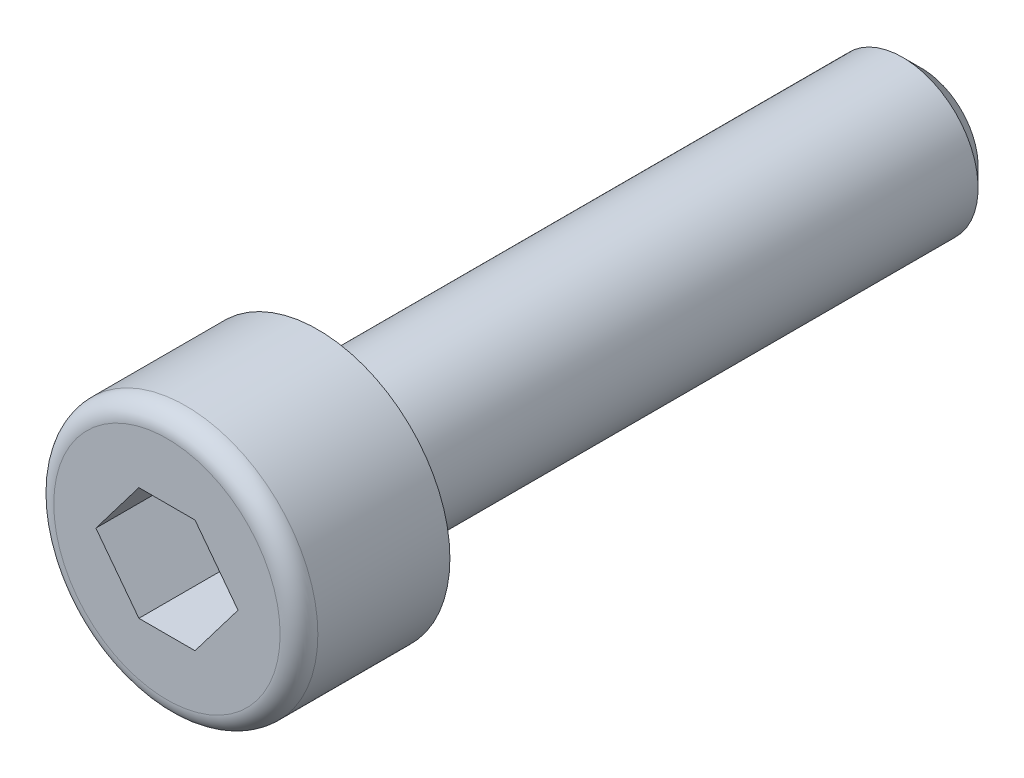
ISO-10303-21;
HEADER;
FILE_DESCRIPTION(('STEP AP214'),'2;1');
FILE_NAME('part.step','',(''),(''),'','','');
FILE_SCHEMA(('AUTOMOTIVE_DESIGN { 1 0 10303 214 1 1 1 1 }'));
ENDSEC;
DATA;
#1=APPLICATION_CONTEXT('core data for automotive mechanical design processes');
#2=APPLICATION_PROTOCOL_DEFINITION('international standard','automotive_design',2000,#1);
#3=PRODUCT_CONTEXT('',#1,'mechanical');
#4=PRODUCT('Part','Part','',(#3));
#5=PRODUCT_RELATED_PRODUCT_CATEGORY('part','',(#4));
#6=PRODUCT_DEFINITION_FORMATION('','',#4);
#7=PRODUCT_DEFINITION_CONTEXT('part definition',#1,'design');
#8=PRODUCT_DEFINITION('design','',#6,#7);
#9=PRODUCT_DEFINITION_SHAPE('','',#8);
#10=(LENGTH_UNIT() NAMED_UNIT(*) SI_UNIT(.MILLI.,.METRE.));
#11=(NAMED_UNIT(*) PLANE_ANGLE_UNIT() SI_UNIT($,.RADIAN.));
#12=(NAMED_UNIT(*) SI_UNIT($,.STERADIAN.) SOLID_ANGLE_UNIT());
#13=UNCERTAINTY_MEASURE_WITH_UNIT(LENGTH_MEASURE(1.E-05),#10,'distance_accuracy_value','');
#14=(GEOMETRIC_REPRESENTATION_CONTEXT(3) GLOBAL_UNCERTAINTY_ASSIGNED_CONTEXT((#13)) GLOBAL_UNIT_ASSIGNED_CONTEXT((#10,
#11,#12)) REPRESENTATION_CONTEXT('',''));
#15=CARTESIAN_POINT('',(0.,0.,0.));
#16=DIRECTION('',(0.,0.,1.));
#17=DIRECTION('',(1.,0.,0.));
#18=AXIS2_PLACEMENT_3D('',#15,#16,#17);
#19=CARTESIAN_POINT('',(0.,0.,0.));
#20=DIRECTION('',(0.,0.,1.));
#21=DIRECTION('',(1.,0.,0.));
#22=AXIS2_PLACEMENT_3D('',#19,#20,#21);
#23=PLANE('',#22);
#24=CARTESIAN_POINT('',(0.,0.,0.));
#25=DIRECTION('',(0.,0.,1.));
#26=DIRECTION('',(1.,0.,0.));
#27=AXIS2_PLACEMENT_3D('',#24,#25,#26);
#28=CIRCLE('',#27,3.5);
#29=CARTESIAN_POINT('',(3.50000000000001,0.,0.));
#30=VERTEX_POINT('',#29);
#31=EDGE_CURVE('E140',#30,#30,#28,.T.);
#32=ORIENTED_EDGE('',*,*,#31,.F.);
#33=EDGE_LOOP('',(#32));
#34=FACE_BOUND('',#33,.T.);
#35=CARTESIAN_POINT('',(0.,0.,0.));
#36=DIRECTION('',(0.,0.,-1.));
#37=DIRECTION('',(-1.,0.,0.));
#38=AXIS2_PLACEMENT_3D('',#35,#36,#37);
#39=CIRCLE('',#38,2.);
#40=CARTESIAN_POINT('',(-2.00000000000001,0.,0.));
#41=VERTEX_POINT('',#40);
#42=EDGE_CURVE('E141',#41,#41,#39,.T.);
#43=ORIENTED_EDGE('',*,*,#42,.F.);
#44=EDGE_LOOP('',(#43));
#45=FACE_BOUND('',#44,.T.);
#46=ADVANCED_FACE('F32',(#34,#45),#23,.F.);
#47=CARTESIAN_POINT('',(0.,0.,4.));
#48=DIRECTION('',(0.,0.,-1.));
#49=DIRECTION('',(-1.,0.,0.));
#50=AXIS2_PLACEMENT_3D('',#47,#48,#49);
#51=CYLINDRICAL_SURFACE('',#50,3.5);
#52=CARTESIAN_POINT('',(0.,0.,3.5));
#53=DIRECTION('',(0.,0.,1.));
#54=DIRECTION('',(1.,0.,0.));
#55=AXIS2_PLACEMENT_3D('',#52,#53,#54);
#56=CIRCLE('',#55,3.5);
#57=CARTESIAN_POINT('',(3.50000000000001,0.,3.5));
#58=VERTEX_POINT('',#57);
#59=EDGE_CURVE('E149',#58,#58,#56,.F.);
#60=ORIENTED_EDGE('',*,*,#59,.T.);
#61=EDGE_LOOP('',(#60));
#62=FACE_BOUND('',#61,.T.);
#63=ORIENTED_EDGE('',*,*,#31,.T.);
#64=EDGE_LOOP('',(#63));
#65=FACE_BOUND('',#64,.T.);
#66=ADVANCED_FACE('F34',(#62,#65),#51,.T.);
#67=CARTESIAN_POINT('',(0.,0.,4.));
#68=DIRECTION('',(0.,0.,1.));
#69=DIRECTION('',(1.,0.,0.));
#70=AXIS2_PLACEMENT_3D('',#67,#68,#69);
#71=PLANE('',#70);
#72=CARTESIAN_POINT('',(0.,0.,4.));
#73=DIRECTION('',(0.,0.,1.));
#74=DIRECTION('',(1.,0.,0.));
#75=AXIS2_PLACEMENT_3D('',#72,#73,#74);
#76=CIRCLE('',#75,3.);
#77=CARTESIAN_POINT('',(3.00000000000001,0.,4.));
#78=VERTEX_POINT('',#77);
#79=EDGE_CURVE('E144',#78,#78,#76,.T.);
#80=ORIENTED_EDGE('',*,*,#79,.T.);
#81=EDGE_LOOP('',(#80));
#82=FACE_BOUND('',#81,.T.);
#83=DIRECTION('',(0.605083267533578,0.796162194123093,0.));
#84=VECTOR('',#83,1.);
#85=CARTESIAN_POINT('',(0.74403821617287,-1.49999999999997,4.));
#86=LINE('',#85,#84);
#87=CARTESIAN_POINT('',(0.74403821617287,-1.49999999999997,4.));
#88=VERTEX_POINT('',#87);
#89=CARTESIAN_POINT('',(1.88403821617277,0.,4.));
#90=VERTEX_POINT('',#89);
#91=EDGE_CURVE('E47',#88,#90,#86,.T.);
#92=ORIENTED_EDGE('',*,*,#91,.F.);
#93=DIRECTION('',(1.,0.,0.));
#94=VECTOR('',#93,1.);
#95=CARTESIAN_POINT('',(-0.744038216172926,-1.49999999999983,4.));
#96=LINE('',#95,#94);
#97=CARTESIAN_POINT('',(-0.744038216172926,-1.49999999999983,4.));
#98=VERTEX_POINT('',#97);
#99=EDGE_CURVE('E116',#98,#88,#96,.T.);
#100=ORIENTED_EDGE('',*,*,#99,.F.);
#101=DIRECTION('',(0.605083267533576,-0.796162194123092,0.));
#102=VECTOR('',#101,1.);
#103=CARTESIAN_POINT('',(-1.88403821617307,0.,4.));
#104=LINE('',#103,#102);
#105=CARTESIAN_POINT('',(-1.88403821617307,0.,4.));
#106=VERTEX_POINT('',#105);
#107=EDGE_CURVE('E110',#106,#98,#104,.T.);
#108=ORIENTED_EDGE('',*,*,#107,.F.);
#109=DIRECTION('',(-0.605083267533578,-0.796162194123093,0.));
#110=VECTOR('',#109,1.);
#111=CARTESIAN_POINT('',(-0.74403821617303,1.50000000000025,3.99999999999992));
#112=LINE('',#111,#110);
#113=CARTESIAN_POINT('',(-0.74403821617303,1.50000000000025,3.99999999999992));
#114=VERTEX_POINT('',#113);
#115=EDGE_CURVE('E108',#114,#106,#112,.T.);
#116=ORIENTED_EDGE('',*,*,#115,.F.);
#117=DIRECTION('',(-1.,0.,0.));
#118=VECTOR('',#117,1.);
#119=CARTESIAN_POINT('',(0.744038216172745,1.50000000000019,3.99999999999992));
#120=LINE('',#119,#118);
#121=CARTESIAN_POINT('',(0.744038216172745,1.50000000000019,3.99999999999992));
#122=VERTEX_POINT('',#121);
#123=EDGE_CURVE('E90',#122,#114,#120,.T.);
#124=ORIENTED_EDGE('',*,*,#123,.F.);
#125=DIRECTION('',(-0.605083267533576,0.796162194123092,0.));
#126=VECTOR('',#125,1.);
#127=CARTESIAN_POINT('',(1.88403821617277,0.,4.));
#128=LINE('',#127,#126);
#129=EDGE_CURVE('E101',#90,#122,#128,.T.);
#130=ORIENTED_EDGE('',*,*,#129,.F.);
#131=EDGE_LOOP('',(#92,#100,#108,#116,#124,#130));
#132=FACE_BOUND('',#131,.T.);
#133=ADVANCED_FACE('F105',(#82,#132),#71,.T.);
#134=CARTESIAN_POINT('',(0.,0.,-16.0000000000001));
#135=DIRECTION('',(0.,0.,1.));
#136=DIRECTION('',(1.,0.,0.));
#137=AXIS2_PLACEMENT_3D('',#134,#135,#136);
#138=CYLINDRICAL_SURFACE('',#137,2.);
#139=CARTESIAN_POINT('',(0.,0.,-15.5000000000001));
#140=DIRECTION('',(0.,0.,-1.));
#141=DIRECTION('',(-1.,0.,0.));
#142=AXIS2_PLACEMENT_3D('',#139,#140,#141);
#143=CIRCLE('',#142,2.);
#144=CARTESIAN_POINT('',(-2.00000000000001,0.,-15.5000000000001));
#145=VERTEX_POINT('',#144);
#146=EDGE_CURVE('E11',#145,#145,#143,.F.);
#147=ORIENTED_EDGE('',*,*,#146,.T.);
#148=EDGE_LOOP('',(#147));
#149=FACE_BOUND('',#148,.T.);
#150=ORIENTED_EDGE('',*,*,#42,.T.);
#151=EDGE_LOOP('',(#150));
#152=FACE_BOUND('',#151,.T.);
#153=ADVANCED_FACE('F179',(#149,#152),#138,.T.);
#154=CARTESIAN_POINT('',(0.,0.,-16.0000000000001));
#155=DIRECTION('',(0.,0.,-1.));
#156=DIRECTION('',(-1.,0.,0.));
#157=AXIS2_PLACEMENT_3D('',#154,#155,#156);
#158=PLANE('',#157);
#159=CARTESIAN_POINT('',(0.,0.,-16.0000000000001));
#160=DIRECTION('',(0.,0.,-1.));
#161=DIRECTION('',(-1.,0.,0.));
#162=AXIS2_PLACEMENT_3D('',#159,#160,#161);
#163=CIRCLE('',#162,1.49999999999999);
#164=CARTESIAN_POINT('',(-1.5,0.,-16.0000000000001));
#165=VERTEX_POINT('',#164);
#166=EDGE_CURVE('E40',#165,#165,#163,.T.);
#167=ORIENTED_EDGE('',*,*,#166,.T.);
#168=EDGE_LOOP('',(#167));
#169=FACE_BOUND('',#168,.T.);
#170=ADVANCED_FACE('F154',(#169),#158,.T.);
#171=CARTESIAN_POINT('',(0.744038216172856,-1.49999999999993,0.));
#172=DIRECTION('',(0.796162194123092,-0.605083267533576,0.));
#173=DIRECTION('',(0.605083267533579,0.796162194123094,0.));
#174=AXIS2_PLACEMENT_3D('',#171,#172,#173);
#175=PLANE('',#174);
#176=DIRECTION('',(0.,0.,1.));
#177=VECTOR('',#176,1.);
#178=CARTESIAN_POINT('',(0.744038216172856,-1.49999999999993,0.));
#179=LINE('',#178,#177);
#180=CARTESIAN_POINT('',(0.744038216172856,-1.49999999999993,0.));
#181=VERTEX_POINT('',#180);
#182=EDGE_CURVE('E54',#181,#88,#179,.T.);
#183=ORIENTED_EDGE('',*,*,#182,.T.);
#184=ORIENTED_EDGE('',*,*,#91,.T.);
#185=DIRECTION('',(0.,0.,1.));
#186=VECTOR('',#185,1.);
#187=CARTESIAN_POINT('',(1.88403821617279,0.,0.));
#188=LINE('',#187,#186);
#189=CARTESIAN_POINT('',(1.88403821617279,0.,0.));
#190=VERTEX_POINT('',#189);
#191=EDGE_CURVE('E98',#190,#90,#188,.T.);
#192=ORIENTED_EDGE('',*,*,#191,.F.);
#193=DIRECTION('',(0.605083267533578,0.796162194123093,0.));
#194=VECTOR('',#193,1.);
#195=CARTESIAN_POINT('',(0.744038216172856,-1.49999999999993,0.));
#196=LINE('',#195,#194);
#197=EDGE_CURVE('E118',#181,#190,#196,.T.);
#198=ORIENTED_EDGE('',*,*,#197,.F.);
#199=EDGE_LOOP('',(#183,#184,#192,#198));
#200=FACE_BOUND('',#199,.T.);
#201=ADVANCED_FACE('F185',(#200),#175,.F.);
#202=CARTESIAN_POINT('',(-0.744038216173037,-1.49999999999983,0.));
#203=DIRECTION('',(0.,-1.,0.));
#204=DIRECTION('',(0.,0.,-1.));
#205=AXIS2_PLACEMENT_3D('',#202,#203,#204);
#206=PLANE('',#205);
#207=DIRECTION('',(0.,0.,1.));
#208=VECTOR('',#207,1.);
#209=CARTESIAN_POINT('',(-0.744038216173037,-1.49999999999983,0.));
#210=LINE('',#209,#208);
#211=CARTESIAN_POINT('',(-0.744038216173037,-1.49999999999983,0.));
#212=VERTEX_POINT('',#211);
#213=EDGE_CURVE('E137',#212,#98,#210,.T.);
#214=ORIENTED_EDGE('',*,*,#213,.T.);
#215=ORIENTED_EDGE('',*,*,#99,.T.);
#216=ORIENTED_EDGE('',*,*,#182,.F.);
#217=DIRECTION('',(1.,0.,0.));
#218=VECTOR('',#217,1.);
#219=CARTESIAN_POINT('',(-0.744038216173037,-1.49999999999983,0.));
#220=LINE('',#219,#218);
#221=EDGE_CURVE('E130',#212,#181,#220,.T.);
#222=ORIENTED_EDGE('',*,*,#221,.F.);
#223=EDGE_LOOP('',(#214,#215,#216,#222));
#224=FACE_BOUND('',#223,.T.);
#225=ADVANCED_FACE('F194',(#224),#206,.F.);
#226=CARTESIAN_POINT('',(-1.88403821617308,0.,0.));
#227=DIRECTION('',(-0.796162194123093,-0.605083267533578,0.));
#228=DIRECTION('',(0.605083267533577,-0.796162194123093,0.));
#229=AXIS2_PLACEMENT_3D('',#226,#227,#228);
#230=PLANE('',#229);
#231=DIRECTION('',(0.,0.,1.));
#232=VECTOR('',#231,1.);
#233=CARTESIAN_POINT('',(-1.88403821617308,0.,0.));
#234=LINE('',#233,#232);
#235=CARTESIAN_POINT('',(-1.88403821617308,0.,0.));
#236=VERTEX_POINT('',#235);
#237=EDGE_CURVE('E135',#236,#106,#234,.T.);
#238=ORIENTED_EDGE('',*,*,#237,.T.);
#239=ORIENTED_EDGE('',*,*,#107,.T.);
#240=ORIENTED_EDGE('',*,*,#213,.F.);
#241=DIRECTION('',(0.605083267533576,-0.796162194123092,0.));
#242=VECTOR('',#241,1.);
#243=CARTESIAN_POINT('',(-1.88403821617308,0.,0.));
#244=LINE('',#243,#242);
#245=EDGE_CURVE('E127',#236,#212,#244,.T.);
#246=ORIENTED_EDGE('',*,*,#245,.F.);
#247=EDGE_LOOP('',(#238,#239,#240,#246));
#248=FACE_BOUND('',#247,.T.);
#249=ADVANCED_FACE('F199',(#248),#230,.F.);
#250=CARTESIAN_POINT('',(-0.744038216173044,1.50000000000025,0.));
#251=DIRECTION('',(-0.796162194123092,0.605083267533576,0.));
#252=DIRECTION('',(-0.605083267533579,-0.796162194123094,0.));
#253=AXIS2_PLACEMENT_3D('',#250,#251,#252);
#254=PLANE('',#253);
#255=DIRECTION('',(0.,0.,1.));
#256=VECTOR('',#255,1.);
#257=CARTESIAN_POINT('',(-0.744038216173044,1.50000000000025,0.));
#258=LINE('',#257,#256);
#259=CARTESIAN_POINT('',(-0.744038216173044,1.50000000000025,0.));
#260=VERTEX_POINT('',#259);
#261=EDGE_CURVE('E97',#260,#114,#258,.T.);
#262=ORIENTED_EDGE('',*,*,#261,.T.);
#263=ORIENTED_EDGE('',*,*,#115,.T.);
#264=ORIENTED_EDGE('',*,*,#237,.F.);
#265=DIRECTION('',(-0.605083267533578,-0.796162194123093,0.));
#266=VECTOR('',#265,1.);
#267=CARTESIAN_POINT('',(-0.744038216173044,1.50000000000025,0.));
#268=LINE('',#267,#266);
#269=EDGE_CURVE('E124',#260,#236,#268,.T.);
#270=ORIENTED_EDGE('',*,*,#269,.F.);
#271=EDGE_LOOP('',(#262,#263,#264,#270));
#272=FACE_BOUND('',#271,.T.);
#273=ADVANCED_FACE('F207',(#272),#254,.F.);
#274=CARTESIAN_POINT('',(0.744038216172738,1.5000000000002,0.));
#275=DIRECTION('',(0.,1.,0.));
#276=DIRECTION('',(0.,0.,1.));
#277=AXIS2_PLACEMENT_3D('',#274,#275,#276);
#278=PLANE('',#277);
#279=DIRECTION('',(0.,0.,1.));
#280=VECTOR('',#279,1.);
#281=CARTESIAN_POINT('',(0.744038216172738,1.5000000000002,0.));
#282=LINE('',#281,#280);
#283=CARTESIAN_POINT('',(0.744038216172738,1.5000000000002,0.));
#284=VERTEX_POINT('',#283);
#285=EDGE_CURVE('E86',#284,#122,#282,.T.);
#286=ORIENTED_EDGE('',*,*,#285,.T.);
#287=ORIENTED_EDGE('',*,*,#123,.T.);
#288=ORIENTED_EDGE('',*,*,#261,.F.);
#289=DIRECTION('',(-1.,0.,0.));
#290=VECTOR('',#289,1.);
#291=CARTESIAN_POINT('',(0.744038216172738,1.5000000000002,0.));
#292=LINE('',#291,#290);
#293=EDGE_CURVE('E93',#284,#260,#292,.T.);
#294=ORIENTED_EDGE('',*,*,#293,.F.);
#295=EDGE_LOOP('',(#286,#287,#288,#294));
#296=FACE_BOUND('',#295,.T.);
#297=ADVANCED_FACE('F88',(#296),#278,.F.);
#298=CARTESIAN_POINT('',(1.88403821617279,0.,0.));
#299=DIRECTION('',(0.796162194123093,0.605083267533578,0.));
#300=DIRECTION('',(-0.605083267533577,0.796162194123093,0.));
#301=AXIS2_PLACEMENT_3D('',#298,#299,#300);
#302=PLANE('',#301);
#303=DIRECTION('',(-0.605083267533576,0.796162194123092,0.));
#304=VECTOR('',#303,1.);
#305=CARTESIAN_POINT('',(1.88403821617279,0.,0.));
#306=LINE('',#305,#304);
#307=EDGE_CURVE('E121',#190,#284,#306,.T.);
#308=ORIENTED_EDGE('',*,*,#307,.F.);
#309=ORIENTED_EDGE('',*,*,#191,.T.);
#310=ORIENTED_EDGE('',*,*,#129,.T.);
#311=ORIENTED_EDGE('',*,*,#285,.F.);
#312=EDGE_LOOP('',(#308,#309,#310,#311));
#313=FACE_BOUND('',#312,.T.);
#314=ADVANCED_FACE('F102',(#313),#302,.F.);
#315=CARTESIAN_POINT('',(1.88403821617279,0.,0.));
#316=DIRECTION('',(0.,0.,1.));
#317=DIRECTION('',(1.,0.,0.));
#318=AXIS2_PLACEMENT_3D('',#315,#316,#317);
#319=PLANE('',#318);
#320=ORIENTED_EDGE('',*,*,#197,.T.);
#321=ORIENTED_EDGE('',*,*,#307,.T.);
#322=ORIENTED_EDGE('',*,*,#293,.T.);
#323=ORIENTED_EDGE('',*,*,#269,.T.);
#324=ORIENTED_EDGE('',*,*,#245,.T.);
#325=ORIENTED_EDGE('',*,*,#221,.T.);
#326=EDGE_LOOP('',(#320,#321,#322,#323,#324,#325));
#327=FACE_BOUND('',#326,.T.);
#328=ADVANCED_FACE('F164',(#327),#319,.T.);
#329=CARTESIAN_POINT('',(0.,0.,3.5));
#330=DIRECTION('',(0.,0.,1.));
#331=DIRECTION('',(1.,0.,0.));
#332=AXIS2_PLACEMENT_3D('',#329,#330,#331);
#333=TOROIDAL_SURFACE('',#332,3.,0.5);
#334=ORIENTED_EDGE('',*,*,#59,.F.);
#335=EDGE_LOOP('',(#334));
#336=FACE_BOUND('',#335,.T.);
#337=ORIENTED_EDGE('',*,*,#79,.F.);
#338=EDGE_LOOP('',(#337));
#339=FACE_BOUND('',#338,.T.);
#340=ADVANCED_FACE('F158',(#336,#339),#333,.T.);
#341=CARTESIAN_POINT('',(0.,0.,-16.0000000000001));
#342=DIRECTION('',(0.,0.,1.));
#343=DIRECTION('',(1.,0.,0.));
#344=AXIS2_PLACEMENT_3D('',#341,#342,#343);
#345=CONICAL_SURFACE('',#344,1.49999999999999,0.785398163397453);
#346=ORIENTED_EDGE('',*,*,#146,.F.);
#347=EDGE_LOOP('',(#346));
#348=FACE_BOUND('',#347,.T.);
#349=ORIENTED_EDGE('',*,*,#166,.F.);
#350=EDGE_LOOP('',(#349));
#351=FACE_BOUND('',#350,.T.);
#352=ADVANCED_FACE('F156',(#348,#351),#345,.T.);
#353=CLOSED_SHELL('',(#46,#66,#133,#153,#170,#201,#225,#249,#273,#297,#314,#328,#340,#352));
#354=MANIFOLD_SOLID_BREP('B2',#353);
#355=ADVANCED_BREP_SHAPE_REPRESENTATION('',(#18,#354),#14);
#356=SHAPE_DEFINITION_REPRESENTATION(#9,#355);
ENDSEC;
END-ISO-10303-21;
